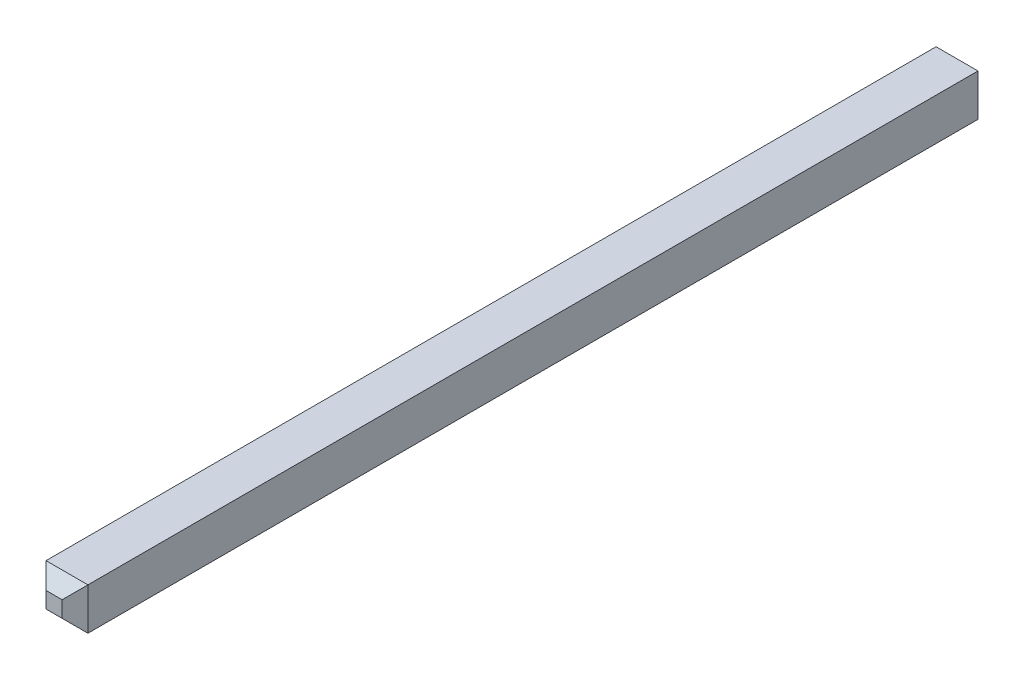
ISO-10303-21;
HEADER;
FILE_DESCRIPTION(('STEP AP214'),'2;1');
FILE_NAME('part.step','',(''),(''),'','','');
FILE_SCHEMA(('AUTOMOTIVE_DESIGN { 1 0 10303 214 1 1 1 1 }'));
ENDSEC;
DATA;
#1=APPLICATION_CONTEXT('core data for automotive mechanical design processes');
#2=APPLICATION_PROTOCOL_DEFINITION('international standard','automotive_design',2000,#1);
#3=PRODUCT_CONTEXT('',#1,'mechanical');
#4=PRODUCT('Part','Part','',(#3));
#5=PRODUCT_RELATED_PRODUCT_CATEGORY('part','',(#4));
#6=PRODUCT_DEFINITION_FORMATION('','',#4);
#7=PRODUCT_DEFINITION_CONTEXT('part definition',#1,'design');
#8=PRODUCT_DEFINITION('design','',#6,#7);
#9=PRODUCT_DEFINITION_SHAPE('','',#8);
#10=(LENGTH_UNIT() NAMED_UNIT(*) SI_UNIT(.MILLI.,.METRE.));
#11=(NAMED_UNIT(*) PLANE_ANGLE_UNIT() SI_UNIT($,.RADIAN.));
#12=(NAMED_UNIT(*) SI_UNIT($,.STERADIAN.) SOLID_ANGLE_UNIT());
#13=UNCERTAINTY_MEASURE_WITH_UNIT(LENGTH_MEASURE(1.E-05),#10,'distance_accuracy_value','');
#14=(GEOMETRIC_REPRESENTATION_CONTEXT(3) GLOBAL_UNCERTAINTY_ASSIGNED_CONTEXT((#13)) GLOBAL_UNIT_ASSIGNED_CONTEXT((#10,
#11,#12)) REPRESENTATION_CONTEXT('',''));
#15=CARTESIAN_POINT('',(0.,0.,0.));
#16=DIRECTION('',(0.,0.,1.));
#17=DIRECTION('',(1.,0.,0.));
#18=AXIS2_PLACEMENT_3D('',#15,#16,#17);
#19=CARTESIAN_POINT('',(-0.225,0.,-0.1));
#20=DIRECTION('',(-0.707106781186548,0.,0.707106781186548));
#21=DIRECTION('',(0.707106781186548,0.,0.707106781186548));
#22=AXIS2_PLACEMENT_3D('',#19,#20,#21);
#23=PLANE('',#22);
#24=DIRECTION('',(0.,1.,0.));
#25=VECTOR('',#24,1.);
#26=CARTESIAN_POINT('',(-0.325,0.325,-0.2));
#27=LINE('',#26,#25);
#28=CARTESIAN_POINT('',(-0.325,-0.325,-0.2));
#29=VERTEX_POINT('',#28);
#30=CARTESIAN_POINT('',(-0.325,0.325,-0.2));
#31=VERTEX_POINT('',#30);
#32=EDGE_CURVE('E114',#29,#31,#27,.T.);
#33=ORIENTED_EDGE('',*,*,#32,.F.);
#34=DIRECTION('',(-0.577350269189626,-0.577350269189626,-0.577350269189626));
#35=VECTOR('',#34,1.);
#36=CARTESIAN_POINT('',(-0.125,-0.125,0.));
#37=LINE('',#36,#35);
#38=CARTESIAN_POINT('',(-0.125,-0.125,0.));
#39=VERTEX_POINT('',#38);
#40=EDGE_CURVE('E112',#39,#29,#37,.T.);
#41=ORIENTED_EDGE('',*,*,#40,.F.);
#42=DIRECTION('',(0.,1.,0.));
#43=VECTOR('',#42,1.);
#44=CARTESIAN_POINT('',(-0.125,0.,0.));
#45=LINE('',#44,#43);
#46=CARTESIAN_POINT('',(-0.125,0.125,0.));
#47=VERTEX_POINT('',#46);
#48=EDGE_CURVE('E19',#47,#39,#45,.F.);
#49=ORIENTED_EDGE('',*,*,#48,.F.);
#50=DIRECTION('',(0.577350269189626,-0.577350269189626,0.577350269189626));
#51=VECTOR('',#50,1.);
#52=CARTESIAN_POINT('',(-0.325,0.325,-0.2));
#53=LINE('',#52,#51);
#54=EDGE_CURVE('E138',#31,#47,#53,.T.);
#55=ORIENTED_EDGE('',*,*,#54,.F.);
#56=EDGE_LOOP('',(#33,#41,#49,#55));
#57=FACE_BOUND('',#56,.T.);
#58=ADVANCED_FACE('F16',(#57),#23,.T.);
#59=CARTESIAN_POINT('',(-0.225,0.,-14.1));
#60=DIRECTION('',(-0.707106781186548,0.,-0.707106781186548));
#61=DIRECTION('',(-0.707106781186548,0.,0.707106781186548));
#62=AXIS2_PLACEMENT_3D('',#59,#60,#61);
#63=PLANE('',#62);
#64=DIRECTION('',(0.,1.,0.));
#65=VECTOR('',#64,1.);
#66=CARTESIAN_POINT('',(-0.125,0.,-14.2));
#67=LINE('',#66,#65);
#68=CARTESIAN_POINT('',(-0.125,0.125,-14.2));
#69=VERTEX_POINT('',#68);
#70=CARTESIAN_POINT('',(-0.125,-0.125,-14.2));
#71=VERTEX_POINT('',#70);
#72=EDGE_CURVE('E95',#69,#71,#67,.F.);
#73=ORIENTED_EDGE('',*,*,#72,.T.);
#74=DIRECTION('',(0.577350269189625,0.577350269189626,-0.577350269189626));
#75=VECTOR('',#74,1.);
#76=CARTESIAN_POINT('',(-0.325,-0.325000000000001,-14.));
#77=LINE('',#76,#75);
#78=CARTESIAN_POINT('',(-0.325,-0.325,-14.));
#79=VERTEX_POINT('',#78);
#80=EDGE_CURVE('E130',#79,#71,#77,.T.);
#81=ORIENTED_EDGE('',*,*,#80,.F.);
#82=DIRECTION('',(0.,1.,0.));
#83=VECTOR('',#82,1.);
#84=CARTESIAN_POINT('',(-0.325,0.325,-14.));
#85=LINE('',#84,#83);
#86=CARTESIAN_POINT('',(-0.325,0.325,-14.));
#87=VERTEX_POINT('',#86);
#88=EDGE_CURVE('E151',#87,#79,#85,.F.);
#89=ORIENTED_EDGE('',*,*,#88,.F.);
#90=DIRECTION('',(-0.577350269189625,0.577350269189626,0.577350269189626));
#91=VECTOR('',#90,1.);
#92=CARTESIAN_POINT('',(-0.125,0.125,-14.2));
#93=LINE('',#92,#91);
#94=EDGE_CURVE('E146',#69,#87,#93,.T.);
#95=ORIENTED_EDGE('',*,*,#94,.F.);
#96=EDGE_LOOP('',(#73,#81,#89,#95));
#97=FACE_BOUND('',#96,.T.);
#98=ADVANCED_FACE('F331',(#97),#63,.T.);
#99=CARTESIAN_POINT('',(0.,0.,0.));
#100=DIRECTION('',(0.,0.,1.));
#101=DIRECTION('',(1.,0.,0.));
#102=AXIS2_PLACEMENT_3D('',#99,#100,#101);
#103=PLANE('',#102);
#104=ORIENTED_EDGE('',*,*,#48,.T.);
#105=DIRECTION('',(1.,0.,0.));
#106=VECTOR('',#105,1.);
#107=CARTESIAN_POINT('',(0.,-0.125,0.));
#108=LINE('',#107,#106);
#109=CARTESIAN_POINT('',(0.125,-0.125,0.));
#110=VERTEX_POINT('',#109);
#111=EDGE_CURVE('E105',#110,#39,#108,.F.);
#112=ORIENTED_EDGE('',*,*,#111,.F.);
#113=DIRECTION('',(0.,1.,0.));
#114=VECTOR('',#113,1.);
#115=CARTESIAN_POINT('',(0.125,0.,0.));
#116=LINE('',#115,#114);
#117=CARTESIAN_POINT('',(0.125,0.125,0.));
#118=VERTEX_POINT('',#117);
#119=EDGE_CURVE('E159',#118,#110,#116,.F.);
#120=ORIENTED_EDGE('',*,*,#119,.F.);
#121=DIRECTION('',(1.,0.,0.));
#122=VECTOR('',#121,1.);
#123=CARTESIAN_POINT('',(0.,0.125,0.));
#124=LINE('',#123,#122);
#125=EDGE_CURVE('E107',#47,#118,#124,.T.);
#126=ORIENTED_EDGE('',*,*,#125,.F.);
#127=EDGE_LOOP('',(#104,#112,#120,#126));
#128=FACE_BOUND('',#127,.T.);
#129=ADVANCED_FACE('F102',(#128),#103,.T.);
#130=CARTESIAN_POINT('',(0.,-0.225,-0.1));
#131=DIRECTION('',(0.,-0.707106781186548,0.707106781186548));
#132=DIRECTION('',(0.,-0.707106781186548,-0.707106781186548));
#133=AXIS2_PLACEMENT_3D('',#130,#131,#132);
#134=PLANE('',#133);
#135=ORIENTED_EDGE('',*,*,#111,.T.);
#136=ORIENTED_EDGE('',*,*,#40,.T.);
#137=DIRECTION('',(1.,0.,0.));
#138=VECTOR('',#137,1.);
#139=CARTESIAN_POINT('',(-0.325,-0.325,-0.2));
#140=LINE('',#139,#138);
#141=CARTESIAN_POINT('',(0.325,-0.325,-0.2));
#142=VERTEX_POINT('',#141);
#143=EDGE_CURVE('E164',#142,#29,#140,.F.);
#144=ORIENTED_EDGE('',*,*,#143,.F.);
#145=DIRECTION('',(0.577350269189626,-0.577350269189626,-0.577350269189626));
#146=VECTOR('',#145,1.);
#147=CARTESIAN_POINT('',(0.125,-0.125,0.));
#148=LINE('',#147,#146);
#149=EDGE_CURVE('E121',#110,#142,#148,.T.);
#150=ORIENTED_EDGE('',*,*,#149,.F.);
#151=EDGE_LOOP('',(#135,#136,#144,#150));
#152=FACE_BOUND('',#151,.T.);
#153=ADVANCED_FACE('F119',(#152),#134,.T.);
#154=CARTESIAN_POINT('',(0.,0.,-14.2));
#155=DIRECTION('',(0.,0.,1.));
#156=DIRECTION('',(1.,0.,0.));
#157=AXIS2_PLACEMENT_3D('',#154,#155,#156);
#158=PLANE('',#157);
#159=DIRECTION('',(0.,1.,0.));
#160=VECTOR('',#159,1.);
#161=CARTESIAN_POINT('',(0.125,0.,-14.2));
#162=LINE('',#161,#160);
#163=CARTESIAN_POINT('',(0.125,-0.125,-14.2));
#164=VERTEX_POINT('',#163);
#165=CARTESIAN_POINT('',(0.125,0.125,-14.2));
#166=VERTEX_POINT('',#165);
#167=EDGE_CURVE('E175',#164,#166,#162,.T.);
#168=ORIENTED_EDGE('',*,*,#167,.F.);
#169=DIRECTION('',(1.,0.,0.));
#170=VECTOR('',#169,1.);
#171=CARTESIAN_POINT('',(0.,-0.125,-14.2));
#172=LINE('',#171,#170);
#173=EDGE_CURVE('E134',#71,#164,#172,.T.);
#174=ORIENTED_EDGE('',*,*,#173,.F.);
#175=ORIENTED_EDGE('',*,*,#72,.F.);
#176=DIRECTION('',(1.,0.,0.));
#177=VECTOR('',#176,1.);
#178=CARTESIAN_POINT('',(0.,0.125,-14.2));
#179=LINE('',#178,#177);
#180=EDGE_CURVE('E142',#166,#69,#179,.F.);
#181=ORIENTED_EDGE('',*,*,#180,.F.);
#182=EDGE_LOOP('',(#168,#174,#175,#181));
#183=FACE_BOUND('',#182,.T.);
#184=ADVANCED_FACE('F307',(#183),#158,.F.);
#185=CARTESIAN_POINT('',(0.,-0.225,-14.1));
#186=DIRECTION('',(0.,-0.707106781186548,-0.707106781186548));
#187=DIRECTION('',(0.,0.707106781186548,-0.707106781186548));
#188=AXIS2_PLACEMENT_3D('',#185,#186,#187);
#189=PLANE('',#188);
#190=ORIENTED_EDGE('',*,*,#173,.T.);
#191=DIRECTION('',(-0.577350269189626,0.577350269189625,-0.577350269189626));
#192=VECTOR('',#191,1.);
#193=CARTESIAN_POINT('',(0.325000000000001,-0.325,-14.));
#194=LINE('',#193,#192);
#195=CARTESIAN_POINT('',(0.325,-0.325,-14.));
#196=VERTEX_POINT('',#195);
#197=EDGE_CURVE('E182',#196,#164,#194,.T.);
#198=ORIENTED_EDGE('',*,*,#197,.F.);
#199=DIRECTION('',(1.,0.,0.));
#200=VECTOR('',#199,1.);
#201=CARTESIAN_POINT('',(-0.325,-0.325,-14.));
#202=LINE('',#201,#200);
#203=EDGE_CURVE('E171',#79,#196,#202,.T.);
#204=ORIENTED_EDGE('',*,*,#203,.F.);
#205=ORIENTED_EDGE('',*,*,#80,.T.);
#206=EDGE_LOOP('',(#190,#198,#204,#205));
#207=FACE_BOUND('',#206,.T.);
#208=ADVANCED_FACE('F299',(#207),#189,.T.);
#209=CARTESIAN_POINT('',(0.,0.225,-0.1));
#210=DIRECTION('',(0.,0.707106781186548,0.707106781186548));
#211=DIRECTION('',(0.,-0.707106781186548,0.707106781186548));
#212=AXIS2_PLACEMENT_3D('',#209,#210,#211);
#213=PLANE('',#212);
#214=ORIENTED_EDGE('',*,*,#125,.T.);
#215=DIRECTION('',(-0.577350269189626,-0.577350269189626,0.577350269189626));
#216=VECTOR('',#215,1.);
#217=CARTESIAN_POINT('',(0.325,0.325,-0.2));
#218=LINE('',#217,#216);
#219=CARTESIAN_POINT('',(0.325,0.325,-0.2));
#220=VERTEX_POINT('',#219);
#221=EDGE_CURVE('E155',#220,#118,#218,.T.);
#222=ORIENTED_EDGE('',*,*,#221,.F.);
#223=DIRECTION('',(1.,0.,0.));
#224=VECTOR('',#223,1.);
#225=CARTESIAN_POINT('',(0.325,0.325,-0.2));
#226=LINE('',#225,#224);
#227=EDGE_CURVE('E186',#31,#220,#226,.T.);
#228=ORIENTED_EDGE('',*,*,#227,.F.);
#229=ORIENTED_EDGE('',*,*,#54,.T.);
#230=EDGE_LOOP('',(#214,#222,#228,#229));
#231=FACE_BOUND('',#230,.T.);
#232=ADVANCED_FACE('F218',(#231),#213,.T.);
#233=CARTESIAN_POINT('',(0.,0.225,-14.1));
#234=DIRECTION('',(0.,0.707106781186548,-0.707106781186548));
#235=DIRECTION('',(0.,0.707106781186548,0.707106781186548));
#236=AXIS2_PLACEMENT_3D('',#233,#234,#235);
#237=PLANE('',#236);
#238=DIRECTION('',(1.,0.,0.));
#239=VECTOR('',#238,1.);
#240=CARTESIAN_POINT('',(0.325,0.325,-14.));
#241=LINE('',#240,#239);
#242=CARTESIAN_POINT('',(0.325,0.325,-14.));
#243=VERTEX_POINT('',#242);
#244=EDGE_CURVE('E38',#243,#87,#241,.F.);
#245=ORIENTED_EDGE('',*,*,#244,.F.);
#246=DIRECTION('',(0.577350269189626,0.577350269189625,0.577350269189626));
#247=VECTOR('',#246,1.);
#248=CARTESIAN_POINT('',(0.125,0.125,-14.2));
#249=LINE('',#248,#247);
#250=EDGE_CURVE('E179',#166,#243,#249,.T.);
#251=ORIENTED_EDGE('',*,*,#250,.F.);
#252=ORIENTED_EDGE('',*,*,#180,.T.);
#253=ORIENTED_EDGE('',*,*,#94,.T.);
#254=EDGE_LOOP('',(#245,#251,#252,#253));
#255=FACE_BOUND('',#254,.T.);
#256=ADVANCED_FACE('F236',(#255),#237,.T.);
#257=CARTESIAN_POINT('',(-0.325,0.325,0.));
#258=DIRECTION('',(-1.,0.,0.));
#259=DIRECTION('',(0.,0.,1.));
#260=AXIS2_PLACEMENT_3D('',#257,#258,#259);
#261=PLANE('',#260);
#262=ORIENTED_EDGE('',*,*,#88,.T.);
#263=DIRECTION('',(0.,0.,-1.));
#264=VECTOR('',#263,1.);
#265=CARTESIAN_POINT('',(-0.325,-0.325,0.));
#266=LINE('',#265,#264);
#267=EDGE_CURVE('E167',#29,#79,#266,.T.);
#268=ORIENTED_EDGE('',*,*,#267,.F.);
#269=ORIENTED_EDGE('',*,*,#32,.T.);
#270=DIRECTION('',(0.,0.,1.));
#271=VECTOR('',#270,1.);
#272=CARTESIAN_POINT('',(-0.325,0.325,0.));
#273=LINE('',#272,#271);
#274=EDGE_CURVE('E192',#87,#31,#273,.T.);
#275=ORIENTED_EDGE('',*,*,#274,.F.);
#276=EDGE_LOOP('',(#262,#268,#269,#275));
#277=FACE_BOUND('',#276,.T.);
#278=ADVANCED_FACE('F221',(#277),#261,.T.);
#279=CARTESIAN_POINT('',(0.225,0.,-0.1));
#280=DIRECTION('',(0.707106781186548,0.,0.707106781186548));
#281=DIRECTION('',(0.707106781186548,0.,-0.707106781186548));
#282=AXIS2_PLACEMENT_3D('',#279,#280,#281);
#283=PLANE('',#282);
#284=ORIENTED_EDGE('',*,*,#119,.T.);
#285=ORIENTED_EDGE('',*,*,#149,.T.);
#286=DIRECTION('',(0.,1.,0.));
#287=VECTOR('',#286,1.);
#288=CARTESIAN_POINT('',(0.325,-0.325,-0.2));
#289=LINE('',#288,#287);
#290=EDGE_CURVE('E196',#220,#142,#289,.F.);
#291=ORIENTED_EDGE('',*,*,#290,.F.);
#292=ORIENTED_EDGE('',*,*,#221,.T.);
#293=EDGE_LOOP('',(#284,#285,#291,#292));
#294=FACE_BOUND('',#293,.T.);
#295=ADVANCED_FACE('F226',(#294),#283,.T.);
#296=CARTESIAN_POINT('',(-0.325,-0.325,0.));
#297=DIRECTION('',(0.,-1.,0.));
#298=DIRECTION('',(0.,0.,-1.));
#299=AXIS2_PLACEMENT_3D('',#296,#297,#298);
#300=PLANE('',#299);
#301=ORIENTED_EDGE('',*,*,#203,.T.);
#302=DIRECTION('',(0.,0.,-1.));
#303=VECTOR('',#302,1.);
#304=CARTESIAN_POINT('',(0.325,-0.325,0.));
#305=LINE('',#304,#303);
#306=EDGE_CURVE('E200',#142,#196,#305,.T.);
#307=ORIENTED_EDGE('',*,*,#306,.F.);
#308=ORIENTED_EDGE('',*,*,#143,.T.);
#309=ORIENTED_EDGE('',*,*,#267,.T.);
#310=EDGE_LOOP('',(#301,#307,#308,#309));
#311=FACE_BOUND('',#310,.T.);
#312=ADVANCED_FACE('F224',(#311),#300,.T.);
#313=CARTESIAN_POINT('',(0.225,0.,-14.1));
#314=DIRECTION('',(0.707106781186548,0.,-0.707106781186548));
#315=DIRECTION('',(-0.707106781186548,0.,-0.707106781186548));
#316=AXIS2_PLACEMENT_3D('',#313,#314,#315);
#317=PLANE('',#316);
#318=DIRECTION('',(0.,1.,0.));
#319=VECTOR('',#318,1.);
#320=CARTESIAN_POINT('',(0.325,-0.325,-14.));
#321=LINE('',#320,#319);
#322=EDGE_CURVE('E26',#196,#243,#321,.T.);
#323=ORIENTED_EDGE('',*,*,#322,.F.);
#324=ORIENTED_EDGE('',*,*,#197,.T.);
#325=ORIENTED_EDGE('',*,*,#167,.T.);
#326=ORIENTED_EDGE('',*,*,#250,.T.);
#327=EDGE_LOOP('',(#323,#324,#325,#326));
#328=FACE_BOUND('',#327,.T.);
#329=ADVANCED_FACE('F212',(#328),#317,.T.);
#330=CARTESIAN_POINT('',(0.325,0.325,0.));
#331=DIRECTION('',(0.,1.,0.));
#332=DIRECTION('',(0.,0.,1.));
#333=AXIS2_PLACEMENT_3D('',#330,#331,#332);
#334=PLANE('',#333);
#335=ORIENTED_EDGE('',*,*,#244,.T.);
#336=ORIENTED_EDGE('',*,*,#274,.T.);
#337=ORIENTED_EDGE('',*,*,#227,.T.);
#338=DIRECTION('',(0.,0.,-1.));
#339=VECTOR('',#338,1.);
#340=CARTESIAN_POINT('',(0.325,0.325,0.));
#341=LINE('',#340,#339);
#342=EDGE_CURVE('E11',#243,#220,#341,.F.);
#343=ORIENTED_EDGE('',*,*,#342,.F.);
#344=EDGE_LOOP('',(#335,#336,#337,#343));
#345=FACE_BOUND('',#344,.T.);
#346=ADVANCED_FACE('F214',(#345),#334,.T.);
#347=CARTESIAN_POINT('',(0.325,-0.325,0.));
#348=DIRECTION('',(1.,0.,0.));
#349=DIRECTION('',(0.,0.,-1.));
#350=AXIS2_PLACEMENT_3D('',#347,#348,#349);
#351=PLANE('',#350);
#352=ORIENTED_EDGE('',*,*,#322,.T.);
#353=ORIENTED_EDGE('',*,*,#342,.T.);
#354=ORIENTED_EDGE('',*,*,#290,.T.);
#355=ORIENTED_EDGE('',*,*,#306,.T.);
#356=EDGE_LOOP('',(#352,#353,#354,#355));
#357=FACE_BOUND('',#356,.T.);
#358=ADVANCED_FACE('F208',(#357),#351,.T.);
#359=CLOSED_SHELL('',(#58,#98,#129,#153,#184,#208,#232,#256,#278,#295,#312,#329,#346,#358));
#360=MANIFOLD_SOLID_BREP('B1',#359);
#361=ADVANCED_BREP_SHAPE_REPRESENTATION('',(#18,#360),#14);
#362=SHAPE_DEFINITION_REPRESENTATION(#9,#361);
ENDSEC;
END-ISO-10303-21;
